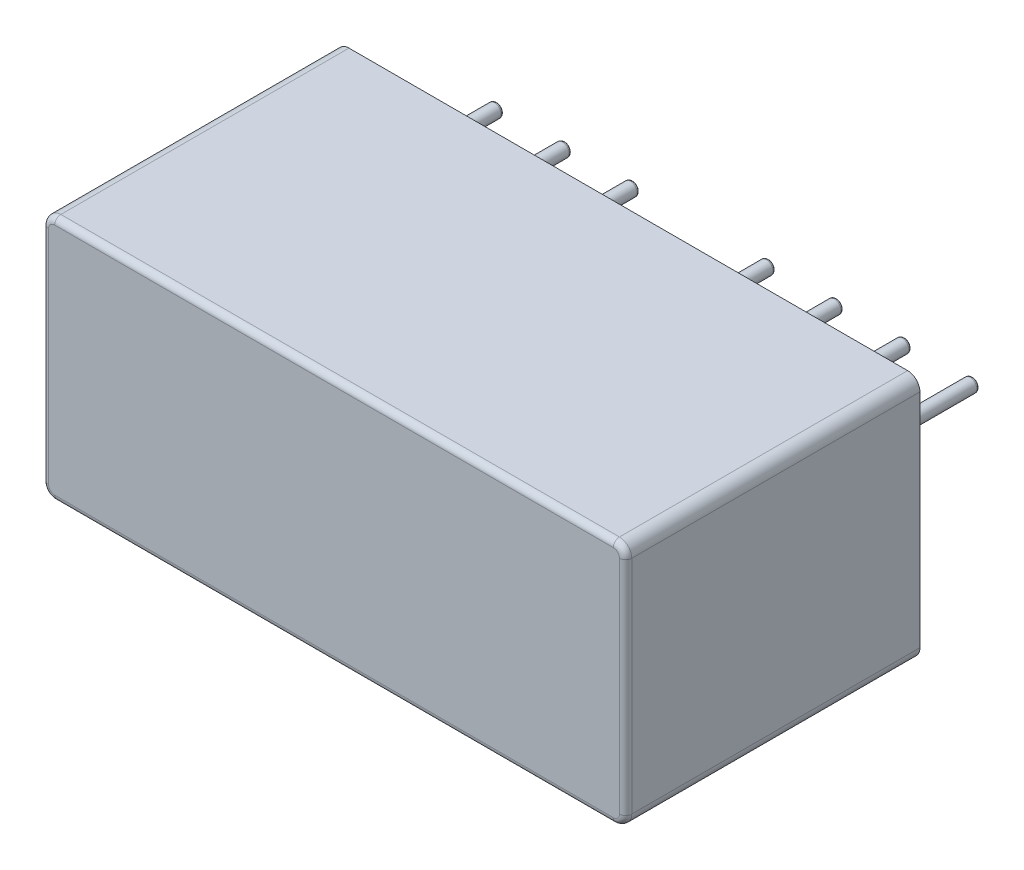
ISO-10303-21;
HEADER;
FILE_DESCRIPTION(('STEP AP214'),'2;1');
FILE_NAME('part.step','',(''),(''),'','','');
FILE_SCHEMA(('AUTOMOTIVE_DESIGN { 1 0 10303 214 1 1 1 1 }'));
ENDSEC;
DATA;
#1=APPLICATION_CONTEXT('core data for automotive mechanical design processes');
#2=APPLICATION_PROTOCOL_DEFINITION('international standard','automotive_design',2000,#1);
#3=PRODUCT_CONTEXT('',#1,'mechanical');
#4=PRODUCT('Part','Part','',(#3));
#5=PRODUCT_RELATED_PRODUCT_CATEGORY('part','',(#4));
#6=PRODUCT_DEFINITION_FORMATION('','',#4);
#7=PRODUCT_DEFINITION_CONTEXT('part definition',#1,'design');
#8=PRODUCT_DEFINITION('design','',#6,#7);
#9=PRODUCT_DEFINITION_SHAPE('','',#8);
#10=(LENGTH_UNIT() NAMED_UNIT(*) SI_UNIT(.MILLI.,.METRE.));
#11=(NAMED_UNIT(*) PLANE_ANGLE_UNIT() SI_UNIT($,.RADIAN.));
#12=(NAMED_UNIT(*) SI_UNIT($,.STERADIAN.) SOLID_ANGLE_UNIT());
#13=UNCERTAINTY_MEASURE_WITH_UNIT(LENGTH_MEASURE(1.E-05),#10,'distance_accuracy_value','');
#14=(GEOMETRIC_REPRESENTATION_CONTEXT(3) GLOBAL_UNCERTAINTY_ASSIGNED_CONTEXT((#13)) GLOBAL_UNIT_ASSIGNED_CONTEXT((#10,
#11,#12)) REPRESENTATION_CONTEXT('',''));
#15=CARTESIAN_POINT('',(0.,0.,0.));
#16=DIRECTION('',(0.,0.,1.));
#17=DIRECTION('',(1.,0.,0.));
#18=AXIS2_PLACEMENT_3D('',#15,#16,#17);
#19=CARTESIAN_POINT('',(0.,0.,-3.9));
#20=DIRECTION('',(0.,0.,1.));
#21=DIRECTION('',(1.,0.,0.));
#22=AXIS2_PLACEMENT_3D('',#19,#20,#21);
#23=PLANE('',#22);
#24=CARTESIAN_POINT('',(0.,0.,-3.9));
#25=DIRECTION('',(0.,0.,1.));
#26=DIRECTION('',(1.,0.,0.));
#27=AXIS2_PLACEMENT_3D('',#24,#25,#26);
#28=CIRCLE('',#27,0.15);
#29=CARTESIAN_POINT('',(0.15,0.,-3.9));
#30=VERTEX_POINT('',#29);
#31=EDGE_CURVE('E27',#30,#30,#28,.T.);
#32=ORIENTED_EDGE('',*,*,#31,.F.);
#33=EDGE_LOOP('',(#32));
#34=FACE_BOUND('',#33,.T.);
#35=ADVANCED_FACE('F17',(#34),#23,.F.);
#36=CARTESIAN_POINT('',(2.54,0.,-3.9));
#37=DIRECTION('',(0.,0.,1.));
#38=DIRECTION('',(1.,0.,0.));
#39=AXIS2_PLACEMENT_3D('',#36,#37,#38);
#40=PLANE('',#39);
#41=CARTESIAN_POINT('',(2.54,0.,-3.9));
#42=DIRECTION('',(0.,0.,1.));
#43=DIRECTION('',(1.,0.,0.));
#44=AXIS2_PLACEMENT_3D('',#41,#42,#43);
#45=CIRCLE('',#44,0.15);
#46=CARTESIAN_POINT('',(2.69,0.,-3.9));
#47=VERTEX_POINT('',#46);
#48=EDGE_CURVE('E398',#47,#47,#45,.T.);
#49=ORIENTED_EDGE('',*,*,#48,.F.);
#50=EDGE_LOOP('',(#49));
#51=FACE_BOUND('',#50,.T.);
#52=ADVANCED_FACE('F569',(#51),#40,.F.);
#53=CARTESIAN_POINT('',(10.16,0.,-3.9));
#54=DIRECTION('',(0.,0.,1.));
#55=DIRECTION('',(1.,0.,0.));
#56=AXIS2_PLACEMENT_3D('',#53,#54,#55);
#57=PLANE('',#56);
#58=CARTESIAN_POINT('',(10.16,0.,-3.9));
#59=DIRECTION('',(0.,0.,1.));
#60=DIRECTION('',(1.,0.,0.));
#61=AXIS2_PLACEMENT_3D('',#58,#59,#60);
#62=CIRCLE('',#61,0.15);
#63=CARTESIAN_POINT('',(10.31,0.,-3.9));
#64=VERTEX_POINT('',#63);
#65=EDGE_CURVE('E336',#64,#64,#62,.T.);
#66=ORIENTED_EDGE('',*,*,#65,.F.);
#67=EDGE_LOOP('',(#66));
#68=FACE_BOUND('',#67,.T.);
#69=ADVANCED_FACE('F576',(#68),#57,.F.);
#70=CARTESIAN_POINT('',(5.08,0.,-3.9));
#71=DIRECTION('',(0.,0.,1.));
#72=DIRECTION('',(1.,0.,0.));
#73=AXIS2_PLACEMENT_3D('',#70,#71,#72);
#74=PLANE('',#73);
#75=CARTESIAN_POINT('',(5.08,0.,-3.9));
#76=DIRECTION('',(0.,0.,1.));
#77=DIRECTION('',(1.,0.,0.));
#78=AXIS2_PLACEMENT_3D('',#75,#76,#77);
#79=CIRCLE('',#78,0.15);
#80=CARTESIAN_POINT('',(5.23,0.,-3.9));
#81=VERTEX_POINT('',#80);
#82=EDGE_CURVE('E334',#81,#81,#79,.T.);
#83=ORIENTED_EDGE('',*,*,#82,.F.);
#84=EDGE_LOOP('',(#83));
#85=FACE_BOUND('',#84,.T.);
#86=ADVANCED_FACE('F628',(#85),#74,.F.);
#87=CARTESIAN_POINT('',(12.7,0.,-3.9));
#88=DIRECTION('',(0.,0.,1.));
#89=DIRECTION('',(1.,0.,0.));
#90=AXIS2_PLACEMENT_3D('',#87,#88,#89);
#91=PLANE('',#90);
#92=CARTESIAN_POINT('',(12.7,0.,-3.9));
#93=DIRECTION('',(0.,0.,1.));
#94=DIRECTION('',(1.,0.,0.));
#95=AXIS2_PLACEMENT_3D('',#92,#93,#94);
#96=CIRCLE('',#95,0.15);
#97=CARTESIAN_POINT('',(12.85,0.,-3.9));
#98=VERTEX_POINT('',#97);
#99=EDGE_CURVE('E335',#98,#98,#96,.T.);
#100=ORIENTED_EDGE('',*,*,#99,.F.);
#101=EDGE_LOOP('',(#100));
#102=FACE_BOUND('',#101,.T.);
#103=ADVANCED_FACE('F625',(#102),#91,.F.);
#104=CARTESIAN_POINT('',(15.24,0.,-3.9));
#105=DIRECTION('',(0.,0.,1.));
#106=DIRECTION('',(1.,0.,0.));
#107=AXIS2_PLACEMENT_3D('',#104,#105,#106);
#108=PLANE('',#107);
#109=CARTESIAN_POINT('',(15.24,0.,-3.9));
#110=DIRECTION('',(0.,0.,1.));
#111=DIRECTION('',(1.,0.,0.));
#112=AXIS2_PLACEMENT_3D('',#109,#110,#111);
#113=CIRCLE('',#112,0.15);
#114=CARTESIAN_POINT('',(15.39,0.,-3.9));
#115=VERTEX_POINT('',#114);
#116=EDGE_CURVE('E306',#115,#115,#113,.T.);
#117=ORIENTED_EDGE('',*,*,#116,.F.);
#118=EDGE_LOOP('',(#117));
#119=FACE_BOUND('',#118,.T.);
#120=ADVANCED_FACE('F627',(#119),#108,.F.);
#121=CARTESIAN_POINT('',(8.9,-1.4,11.1));
#122=DIRECTION('',(0.,0.,-1.));
#123=DIRECTION('',(0.,-1.,0.));
#124=AXIS2_PLACEMENT_3D('',#121,#122,#123);
#125=PLANE('',#124);
#126=CARTESIAN_POINT('',(-1.54,2.74,11.1));
#127=DIRECTION('',(0.,0.,-1.));
#128=DIRECTION('',(-1.,0.,0.));
#129=AXIS2_PLACEMENT_3D('',#126,#127,#128);
#130=CIRCLE('',#129,0.23);
#131=CARTESIAN_POINT('',(-1.77,2.74,11.1));
#132=VERTEX_POINT('',#131);
#133=CARTESIAN_POINT('',(-1.54,2.97,11.1));
#134=VERTEX_POINT('',#133);
#135=EDGE_CURVE('E442',#132,#134,#130,.T.);
#136=ORIENTED_EDGE('',*,*,#135,.F.);
#137=DIRECTION('',(0.,1.,0.));
#138=VECTOR('',#137,1.);
#139=CARTESIAN_POINT('',(-1.77,-5.54,11.1));
#140=LINE('',#139,#138);
#141=CARTESIAN_POINT('',(-1.77,-5.54,11.1));
#142=VERTEX_POINT('',#141);
#143=EDGE_CURVE('E310',#142,#132,#140,.T.);
#144=ORIENTED_EDGE('',*,*,#143,.F.);
#145=CARTESIAN_POINT('',(-1.54,-5.54,11.1));
#146=DIRECTION('',(0.,0.,-1.));
#147=DIRECTION('',(0.,-1.,0.));
#148=AXIS2_PLACEMENT_3D('',#145,#146,#147);
#149=CIRCLE('',#148,0.23);
#150=CARTESIAN_POINT('',(-1.54,-5.77,11.1));
#151=VERTEX_POINT('',#150);
#152=EDGE_CURVE('E352',#151,#142,#149,.T.);
#153=ORIENTED_EDGE('',*,*,#152,.F.);
#154=DIRECTION('',(-1.,0.,0.));
#155=VECTOR('',#154,1.);
#156=CARTESIAN_POINT('',(19.34,-5.77,11.1));
#157=LINE('',#156,#155);
#158=CARTESIAN_POINT('',(19.34,-5.77,11.1));
#159=VERTEX_POINT('',#158);
#160=EDGE_CURVE('E365',#159,#151,#157,.T.);
#161=ORIENTED_EDGE('',*,*,#160,.F.);
#162=CARTESIAN_POINT('',(19.34,-5.54,11.1));
#163=DIRECTION('',(0.,0.,-1.));
#164=DIRECTION('',(1.,0.,0.));
#165=AXIS2_PLACEMENT_3D('',#162,#163,#164);
#166=CIRCLE('',#165,0.23);
#167=CARTESIAN_POINT('',(19.57,-5.54,11.1));
#168=VERTEX_POINT('',#167);
#169=EDGE_CURVE('E271',#168,#159,#166,.T.);
#170=ORIENTED_EDGE('',*,*,#169,.F.);
#171=DIRECTION('',(0.,-1.,0.));
#172=VECTOR('',#171,1.);
#173=CARTESIAN_POINT('',(19.57,2.74,11.1));
#174=LINE('',#173,#172);
#175=CARTESIAN_POINT('',(19.57,2.74,11.1));
#176=VERTEX_POINT('',#175);
#177=EDGE_CURVE('E304',#176,#168,#174,.T.);
#178=ORIENTED_EDGE('',*,*,#177,.F.);
#179=CARTESIAN_POINT('',(19.34,2.74,11.1));
#180=DIRECTION('',(0.,0.,-1.));
#181=DIRECTION('',(0.,1.,0.));
#182=AXIS2_PLACEMENT_3D('',#179,#180,#181);
#183=CIRCLE('',#182,0.23);
#184=CARTESIAN_POINT('',(19.34,2.97,11.1));
#185=VERTEX_POINT('',#184);
#186=EDGE_CURVE('E330',#185,#176,#183,.T.);
#187=ORIENTED_EDGE('',*,*,#186,.F.);
#188=DIRECTION('',(1.,0.,0.));
#189=VECTOR('',#188,1.);
#190=CARTESIAN_POINT('',(-1.54,2.97,11.1));
#191=LINE('',#190,#189);
#192=EDGE_CURVE('E228',#134,#185,#191,.T.);
#193=ORIENTED_EDGE('',*,*,#192,.F.);
#194=EDGE_LOOP('',(#136,#144,#153,#161,#170,#178,#187,#193));
#195=FACE_BOUND('',#194,.T.);
#196=ADVANCED_FACE('F503',(#195),#125,.F.);
#197=CARTESIAN_POINT('',(0.,0.,-3.8));
#198=DIRECTION('',(0.,0.,-1.));
#199=DIRECTION('',(1.,0.,0.));
#200=AXIS2_PLACEMENT_3D('',#197,#198,#199);
#201=TOROIDAL_SURFACE('',#200,0.15,0.1);
#202=ORIENTED_EDGE('',*,*,#31,.T.);
#203=CARTESIAN_POINT('',(0.15,0.,-3.8));
#204=DIRECTION('',(0.,1.,0.));
#205=DIRECTION('',(1.,0.,0.));
#206=AXIS2_PLACEMENT_3D('',#203,#204,#205);
#207=CIRCLE('',#206,0.1);
#208=CARTESIAN_POINT('',(0.25,0.,-3.8));
#209=VERTEX_POINT('',#208);
#210=EDGE_CURVE('E11',#209,#30,#207,.T.);
#211=ORIENTED_EDGE('',*,*,#210,.F.);
#212=CARTESIAN_POINT('',(0.,0.,-3.8));
#213=DIRECTION('',(0.,0.,1.));
#214=DIRECTION('',(1.,0.,0.));
#215=AXIS2_PLACEMENT_3D('',#212,#213,#214);
#216=CIRCLE('',#215,0.25);
#217=EDGE_CURVE('E305',#209,#209,#216,.T.);
#218=ORIENTED_EDGE('',*,*,#217,.F.);
#219=ORIENTED_EDGE('',*,*,#210,.T.);
#220=EDGE_LOOP('',(#202,#211,#218,#219));
#221=FACE_BOUND('',#220,.T.);
#222=ADVANCED_FACE('F612',(#221),#201,.T.);
#223=CARTESIAN_POINT('',(2.54,0.,-3.8));
#224=DIRECTION('',(0.,0.,-1.));
#225=DIRECTION('',(1.,0.,0.));
#226=AXIS2_PLACEMENT_3D('',#223,#224,#225);
#227=TOROIDAL_SURFACE('',#226,0.15,0.1);
#228=ORIENTED_EDGE('',*,*,#48,.T.);
#229=CARTESIAN_POINT('',(2.69,0.,-3.8));
#230=DIRECTION('',(0.,1.,0.));
#231=DIRECTION('',(1.,0.,0.));
#232=AXIS2_PLACEMENT_3D('',#229,#230,#231);
#233=CIRCLE('',#232,0.1);
#234=CARTESIAN_POINT('',(2.79,0.,-3.8));
#235=VERTEX_POINT('',#234);
#236=EDGE_CURVE('E50',#235,#47,#233,.T.);
#237=ORIENTED_EDGE('',*,*,#236,.F.);
#238=CARTESIAN_POINT('',(2.54,0.,-3.8));
#239=DIRECTION('',(0.,0.,1.));
#240=DIRECTION('',(1.,0.,0.));
#241=AXIS2_PLACEMENT_3D('',#238,#239,#240);
#242=CIRCLE('',#241,0.25);
#243=EDGE_CURVE('E284',#235,#235,#242,.T.);
#244=ORIENTED_EDGE('',*,*,#243,.F.);
#245=ORIENTED_EDGE('',*,*,#236,.T.);
#246=EDGE_LOOP('',(#228,#237,#244,#245));
#247=FACE_BOUND('',#246,.T.);
#248=ADVANCED_FACE('F608',(#247),#227,.T.);
#249=CARTESIAN_POINT('',(10.16,0.,-3.8));
#250=DIRECTION('',(0.,0.,-1.));
#251=DIRECTION('',(1.,0.,0.));
#252=AXIS2_PLACEMENT_3D('',#249,#250,#251);
#253=TOROIDAL_SURFACE('',#252,0.15,0.1);
#254=ORIENTED_EDGE('',*,*,#65,.T.);
#255=CARTESIAN_POINT('',(10.31,0.,-3.8));
#256=DIRECTION('',(0.,1.,0.));
#257=DIRECTION('',(1.,0.,0.));
#258=AXIS2_PLACEMENT_3D('',#255,#256,#257);
#259=CIRCLE('',#258,0.1);
#260=CARTESIAN_POINT('',(10.41,0.,-3.8));
#261=VERTEX_POINT('',#260);
#262=EDGE_CURVE('E340',#261,#64,#259,.T.);
#263=ORIENTED_EDGE('',*,*,#262,.F.);
#264=CARTESIAN_POINT('',(10.16,0.,-3.8));
#265=DIRECTION('',(0.,0.,1.));
#266=DIRECTION('',(1.,0.,0.));
#267=AXIS2_PLACEMENT_3D('',#264,#265,#266);
#268=CIRCLE('',#267,0.25);
#269=EDGE_CURVE('E321',#261,#261,#268,.T.);
#270=ORIENTED_EDGE('',*,*,#269,.F.);
#271=ORIENTED_EDGE('',*,*,#262,.T.);
#272=EDGE_LOOP('',(#254,#263,#270,#271));
#273=FACE_BOUND('',#272,.T.);
#274=ADVANCED_FACE('F604',(#273),#253,.T.);
#275=CARTESIAN_POINT('',(5.08,0.,-3.8));
#276=DIRECTION('',(0.,0.,-1.));
#277=DIRECTION('',(1.,0.,0.));
#278=AXIS2_PLACEMENT_3D('',#275,#276,#277);
#279=TOROIDAL_SURFACE('',#278,0.15,0.1);
#280=ORIENTED_EDGE('',*,*,#82,.T.);
#281=CARTESIAN_POINT('',(5.23,0.,-3.8));
#282=DIRECTION('',(0.,1.,0.));
#283=DIRECTION('',(1.,0.,0.));
#284=AXIS2_PLACEMENT_3D('',#281,#282,#283);
#285=CIRCLE('',#284,0.1);
#286=CARTESIAN_POINT('',(5.33,0.,-3.8));
#287=VERTEX_POINT('',#286);
#288=EDGE_CURVE('E341',#287,#81,#285,.T.);
#289=ORIENTED_EDGE('',*,*,#288,.F.);
#290=CARTESIAN_POINT('',(5.08,0.,-3.8));
#291=DIRECTION('',(0.,0.,1.));
#292=DIRECTION('',(1.,0.,0.));
#293=AXIS2_PLACEMENT_3D('',#290,#291,#292);
#294=CIRCLE('',#293,0.25);
#295=EDGE_CURVE('E234',#287,#287,#294,.T.);
#296=ORIENTED_EDGE('',*,*,#295,.F.);
#297=ORIENTED_EDGE('',*,*,#288,.T.);
#298=EDGE_LOOP('',(#280,#289,#296,#297));
#299=FACE_BOUND('',#298,.T.);
#300=ADVANCED_FACE('F607',(#299),#279,.T.);
#301=CARTESIAN_POINT('',(12.7,0.,-3.8));
#302=DIRECTION('',(0.,0.,-1.));
#303=DIRECTION('',(1.,0.,0.));
#304=AXIS2_PLACEMENT_3D('',#301,#302,#303);
#305=TOROIDAL_SURFACE('',#304,0.15,0.1);
#306=ORIENTED_EDGE('',*,*,#99,.T.);
#307=CARTESIAN_POINT('',(12.85,0.,-3.8));
#308=DIRECTION('',(0.,1.,0.));
#309=DIRECTION('',(1.,0.,0.));
#310=AXIS2_PLACEMENT_3D('',#307,#308,#309);
#311=CIRCLE('',#310,0.1);
#312=CARTESIAN_POINT('',(12.95,0.,-3.8));
#313=VERTEX_POINT('',#312);
#314=EDGE_CURVE('E331',#313,#98,#311,.T.);
#315=ORIENTED_EDGE('',*,*,#314,.F.);
#316=CARTESIAN_POINT('',(12.7,0.,-3.8));
#317=DIRECTION('',(0.,0.,1.));
#318=DIRECTION('',(1.,0.,0.));
#319=AXIS2_PLACEMENT_3D('',#316,#317,#318);
#320=CIRCLE('',#319,0.25);
#321=EDGE_CURVE('E235',#313,#313,#320,.T.);
#322=ORIENTED_EDGE('',*,*,#321,.F.);
#323=ORIENTED_EDGE('',*,*,#314,.T.);
#324=EDGE_LOOP('',(#306,#315,#322,#323));
#325=FACE_BOUND('',#324,.T.);
#326=ADVANCED_FACE('F19',(#325),#305,.T.);
#327=CARTESIAN_POINT('',(15.24,0.,-3.8));
#328=DIRECTION('',(0.,0.,-1.));
#329=DIRECTION('',(1.,0.,0.));
#330=AXIS2_PLACEMENT_3D('',#327,#328,#329);
#331=TOROIDAL_SURFACE('',#330,0.15,0.1);
#332=ORIENTED_EDGE('',*,*,#116,.T.);
#333=CARTESIAN_POINT('',(15.39,0.,-3.8));
#334=DIRECTION('',(0.,1.,0.));
#335=DIRECTION('',(1.,0.,0.));
#336=AXIS2_PLACEMENT_3D('',#333,#334,#335);
#337=CIRCLE('',#336,0.1);
#338=CARTESIAN_POINT('',(15.49,0.,-3.8));
#339=VERTEX_POINT('',#338);
#340=EDGE_CURVE('E309',#339,#115,#337,.T.);
#341=ORIENTED_EDGE('',*,*,#340,.F.);
#342=CARTESIAN_POINT('',(15.24,0.,-3.8));
#343=DIRECTION('',(0.,0.,1.));
#344=DIRECTION('',(1.,0.,0.));
#345=AXIS2_PLACEMENT_3D('',#342,#343,#344);
#346=CIRCLE('',#345,0.25);
#347=EDGE_CURVE('E312',#339,#339,#346,.T.);
#348=ORIENTED_EDGE('',*,*,#347,.F.);
#349=ORIENTED_EDGE('',*,*,#340,.T.);
#350=EDGE_LOOP('',(#332,#341,#348,#349));
#351=FACE_BOUND('',#350,.T.);
#352=ADVANCED_FACE('F589',(#351),#331,.T.);
#353=CARTESIAN_POINT('',(-1.77,-5.54,10.87));
#354=DIRECTION('',(0.,1.,0.));
#355=DIRECTION('',(-1.,0.,0.));
#356=AXIS2_PLACEMENT_3D('',#353,#354,#355);
#357=CYLINDRICAL_SURFACE('',#356,0.23);
#358=CARTESIAN_POINT('',(-1.77,-5.54,10.87));
#359=DIRECTION('',(0.,1.,0.));
#360=DIRECTION('',(-1.,0.,0.));
#361=AXIS2_PLACEMENT_3D('',#358,#359,#360);
#362=CIRCLE('',#361,0.23);
#363=CARTESIAN_POINT('',(-2.,-5.54,10.87));
#364=VERTEX_POINT('',#363);
#365=EDGE_CURVE('E356',#364,#142,#362,.T.);
#366=ORIENTED_EDGE('',*,*,#365,.T.);
#367=ORIENTED_EDGE('',*,*,#143,.T.);
#368=CARTESIAN_POINT('',(-1.77,2.74,10.87));
#369=DIRECTION('',(0.,1.,0.));
#370=DIRECTION('',(-1.,0.,0.));
#371=AXIS2_PLACEMENT_3D('',#368,#369,#370);
#372=CIRCLE('',#371,0.23);
#373=CARTESIAN_POINT('',(-2.,2.74,10.87));
#374=VERTEX_POINT('',#373);
#375=EDGE_CURVE('E357',#374,#132,#372,.T.);
#376=ORIENTED_EDGE('',*,*,#375,.F.);
#377=DIRECTION('',(0.,1.,0.));
#378=VECTOR('',#377,1.);
#379=CARTESIAN_POINT('',(-2.,-5.54,10.87));
#380=LINE('',#379,#378);
#381=EDGE_CURVE('E298',#364,#374,#380,.T.);
#382=ORIENTED_EDGE('',*,*,#381,.F.);
#383=EDGE_LOOP('',(#366,#367,#376,#382));
#384=FACE_BOUND('',#383,.T.);
#385=ADVANCED_FACE('F586',(#384),#357,.T.);
#386=CARTESIAN_POINT('',(-1.54,-5.54,10.87));
#387=DIRECTION('',(0.,0.,1.));
#388=DIRECTION('',(0.,-1.,0.));
#389=AXIS2_PLACEMENT_3D('',#386,#387,#388);
#390=DEGENERATE_TOROIDAL_SURFACE('',#389,0.23,0.23,.T.);
#391=ORIENTED_EDGE('',*,*,#152,.T.);
#392=ORIENTED_EDGE('',*,*,#365,.F.);
#393=CARTESIAN_POINT('',(-1.54,-5.54,10.87));
#394=DIRECTION('',(0.,0.,-1.));
#395=DIRECTION('',(0.,-1.,0.));
#396=AXIS2_PLACEMENT_3D('',#393,#394,#395);
#397=CIRCLE('',#396,0.46);
#398=CARTESIAN_POINT('',(-1.54,-6.,10.87));
#399=VERTEX_POINT('',#398);
#400=EDGE_CURVE('E299',#399,#364,#397,.T.);
#401=ORIENTED_EDGE('',*,*,#400,.F.);
#402=CARTESIAN_POINT('',(-1.54,-5.77,10.87));
#403=DIRECTION('',(-1.,0.,0.));
#404=DIRECTION('',(0.,-1.,0.));
#405=AXIS2_PLACEMENT_3D('',#402,#403,#404);
#406=CIRCLE('',#405,0.23);
#407=EDGE_CURVE('E369',#399,#151,#406,.T.);
#408=ORIENTED_EDGE('',*,*,#407,.T.);
#409=EDGE_LOOP('',(#391,#392,#401,#408));
#410=FACE_BOUND('',#409,.T.);
#411=ADVANCED_FACE('F585',(#410),#390,.T.);
#412=CARTESIAN_POINT('',(-1.54,2.74,10.87));
#413=DIRECTION('',(0.,0.,1.));
#414=DIRECTION('',(-1.,0.,0.));
#415=AXIS2_PLACEMENT_3D('',#412,#413,#414);
#416=DEGENERATE_TOROIDAL_SURFACE('',#415,0.23,0.23,.T.);
#417=ORIENTED_EDGE('',*,*,#135,.T.);
#418=CARTESIAN_POINT('',(-1.54,2.97,10.87));
#419=DIRECTION('',(1.,0.,0.));
#420=DIRECTION('',(0.,1.,0.));
#421=AXIS2_PLACEMENT_3D('',#418,#419,#420);
#422=CIRCLE('',#421,0.23);
#423=CARTESIAN_POINT('',(-1.54,3.2,10.87));
#424=VERTEX_POINT('',#423);
#425=EDGE_CURVE('E225',#424,#134,#422,.T.);
#426=ORIENTED_EDGE('',*,*,#425,.F.);
#427=CARTESIAN_POINT('',(-1.54,2.74,10.87));
#428=DIRECTION('',(0.,0.,-1.));
#429=DIRECTION('',(-1.,0.,0.));
#430=AXIS2_PLACEMENT_3D('',#427,#428,#429);
#431=CIRCLE('',#430,0.46);
#432=EDGE_CURVE('E386',#374,#424,#431,.T.);
#433=ORIENTED_EDGE('',*,*,#432,.F.);
#434=ORIENTED_EDGE('',*,*,#375,.T.);
#435=EDGE_LOOP('',(#417,#426,#433,#434));
#436=FACE_BOUND('',#435,.T.);
#437=ADVANCED_FACE('F440',(#436),#416,.T.);
#438=CARTESIAN_POINT('',(19.34,-5.77,10.87));
#439=DIRECTION('',(-1.,0.,0.));
#440=DIRECTION('',(0.,-1.,0.));
#441=AXIS2_PLACEMENT_3D('',#438,#439,#440);
#442=CYLINDRICAL_SURFACE('',#441,0.23);
#443=CARTESIAN_POINT('',(19.34,-5.77,10.87));
#444=DIRECTION('',(-1.,0.,0.));
#445=DIRECTION('',(0.,-1.,0.));
#446=AXIS2_PLACEMENT_3D('',#443,#444,#445);
#447=CIRCLE('',#446,0.23);
#448=CARTESIAN_POINT('',(19.34,-6.,10.87));
#449=VERTEX_POINT('',#448);
#450=EDGE_CURVE('E229',#449,#159,#447,.T.);
#451=ORIENTED_EDGE('',*,*,#450,.T.);
#452=ORIENTED_EDGE('',*,*,#160,.T.);
#453=ORIENTED_EDGE('',*,*,#407,.F.);
#454=DIRECTION('',(-1.,0.,0.));
#455=VECTOR('',#454,1.);
#456=CARTESIAN_POINT('',(19.34,-6.,10.87));
#457=LINE('',#456,#455);
#458=EDGE_CURVE('E290',#449,#399,#457,.T.);
#459=ORIENTED_EDGE('',*,*,#458,.F.);
#460=EDGE_LOOP('',(#451,#452,#453,#459));
#461=FACE_BOUND('',#460,.T.);
#462=ADVANCED_FACE('F506',(#461),#442,.T.);
#463=CARTESIAN_POINT('',(-1.54,2.97,10.87));
#464=DIRECTION('',(1.,0.,0.));
#465=DIRECTION('',(0.,1.,0.));
#466=AXIS2_PLACEMENT_3D('',#463,#464,#465);
#467=CYLINDRICAL_SURFACE('',#466,0.23);
#468=ORIENTED_EDGE('',*,*,#425,.T.);
#469=ORIENTED_EDGE('',*,*,#192,.T.);
#470=CARTESIAN_POINT('',(19.34,2.97,10.87));
#471=DIRECTION('',(1.,0.,0.));
#472=DIRECTION('',(0.,1.,0.));
#473=AXIS2_PLACEMENT_3D('',#470,#471,#472);
#474=CIRCLE('',#473,0.23);
#475=CARTESIAN_POINT('',(19.34,3.2,10.87));
#476=VERTEX_POINT('',#475);
#477=EDGE_CURVE('E385',#476,#185,#474,.T.);
#478=ORIENTED_EDGE('',*,*,#477,.F.);
#479=DIRECTION('',(1.,0.,0.));
#480=VECTOR('',#479,1.);
#481=CARTESIAN_POINT('',(-1.54,3.2,10.87));
#482=LINE('',#481,#480);
#483=EDGE_CURVE('E254',#424,#476,#482,.T.);
#484=ORIENTED_EDGE('',*,*,#483,.F.);
#485=EDGE_LOOP('',(#468,#469,#478,#484));
#486=FACE_BOUND('',#485,.T.);
#487=ADVANCED_FACE('F445',(#486),#467,.T.);
#488=CARTESIAN_POINT('',(19.34,-5.54,10.87));
#489=DIRECTION('',(0.,0.,1.));
#490=DIRECTION('',(1.,0.,0.));
#491=AXIS2_PLACEMENT_3D('',#488,#489,#490);
#492=DEGENERATE_TOROIDAL_SURFACE('',#491,0.23,0.23,.T.);
#493=ORIENTED_EDGE('',*,*,#169,.T.);
#494=ORIENTED_EDGE('',*,*,#450,.F.);
#495=CARTESIAN_POINT('',(19.34,-5.54,10.87));
#496=DIRECTION('',(0.,0.,-1.));
#497=DIRECTION('',(1.,0.,0.));
#498=AXIS2_PLACEMENT_3D('',#495,#496,#497);
#499=CIRCLE('',#498,0.46);
#500=CARTESIAN_POINT('',(19.8,-5.54,10.87));
#501=VERTEX_POINT('',#500);
#502=EDGE_CURVE('E241',#501,#449,#499,.T.);
#503=ORIENTED_EDGE('',*,*,#502,.F.);
#504=CARTESIAN_POINT('',(19.57,-5.54,10.87));
#505=DIRECTION('',(0.,-1.,0.));
#506=DIRECTION('',(1.,0.,0.));
#507=AXIS2_PLACEMENT_3D('',#504,#505,#506);
#508=CIRCLE('',#507,0.23);
#509=EDGE_CURVE('E326',#501,#168,#508,.T.);
#510=ORIENTED_EDGE('',*,*,#509,.T.);
#511=EDGE_LOOP('',(#493,#494,#503,#510));
#512=FACE_BOUND('',#511,.T.);
#513=ADVANCED_FACE('F498',(#512),#492,.T.);
#514=CARTESIAN_POINT('',(19.34,2.74,10.87));
#515=DIRECTION('',(0.,0.,1.));
#516=DIRECTION('',(0.,1.,0.));
#517=AXIS2_PLACEMENT_3D('',#514,#515,#516);
#518=DEGENERATE_TOROIDAL_SURFACE('',#517,0.23,0.23,.T.);
#519=ORIENTED_EDGE('',*,*,#186,.T.);
#520=CARTESIAN_POINT('',(19.57,2.74,10.87));
#521=DIRECTION('',(0.,-1.,0.));
#522=DIRECTION('',(1.,0.,0.));
#523=AXIS2_PLACEMENT_3D('',#520,#521,#522);
#524=CIRCLE('',#523,0.23);
#525=CARTESIAN_POINT('',(19.8,2.74,10.87));
#526=VERTEX_POINT('',#525);
#527=EDGE_CURVE('E300',#526,#176,#524,.T.);
#528=ORIENTED_EDGE('',*,*,#527,.F.);
#529=CARTESIAN_POINT('',(19.34,2.74,10.87));
#530=DIRECTION('',(0.,0.,-1.));
#531=DIRECTION('',(0.,1.,0.));
#532=AXIS2_PLACEMENT_3D('',#529,#530,#531);
#533=CIRCLE('',#532,0.46);
#534=EDGE_CURVE('E257',#476,#526,#533,.T.);
#535=ORIENTED_EDGE('',*,*,#534,.F.);
#536=ORIENTED_EDGE('',*,*,#477,.T.);
#537=EDGE_LOOP('',(#519,#528,#535,#536));
#538=FACE_BOUND('',#537,.T.);
#539=ADVANCED_FACE('F591',(#538),#518,.T.);
#540=CARTESIAN_POINT('',(19.57,2.74,10.87));
#541=DIRECTION('',(0.,-1.,0.));
#542=DIRECTION('',(1.,0.,0.));
#543=AXIS2_PLACEMENT_3D('',#540,#541,#542);
#544=CYLINDRICAL_SURFACE('',#543,0.23);
#545=ORIENTED_EDGE('',*,*,#527,.T.);
#546=ORIENTED_EDGE('',*,*,#177,.T.);
#547=ORIENTED_EDGE('',*,*,#509,.F.);
#548=DIRECTION('',(0.,-1.,0.));
#549=VECTOR('',#548,1.);
#550=CARTESIAN_POINT('',(19.8,2.74,10.87));
#551=LINE('',#550,#549);
#552=EDGE_CURVE('E370',#526,#501,#551,.T.);
#553=ORIENTED_EDGE('',*,*,#552,.F.);
#554=EDGE_LOOP('',(#545,#546,#547,#553));
#555=FACE_BOUND('',#554,.T.);
#556=ADVANCED_FACE('F522',(#555),#544,.T.);
#557=CARTESIAN_POINT('',(0.,0.,0.2));
#558=DIRECTION('',(0.,0.,1.));
#559=DIRECTION('',(1.,0.,0.));
#560=AXIS2_PLACEMENT_3D('',#557,#558,#559);
#561=CYLINDRICAL_SURFACE('',#560,0.25);
#562=CARTESIAN_POINT('',(0.,0.,0.1));
#563=DIRECTION('',(0.,0.,1.));
#564=DIRECTION('',(1.,0.,0.));
#565=AXIS2_PLACEMENT_3D('',#562,#563,#564);
#566=CIRCLE('',#565,0.25);
#567=CARTESIAN_POINT('',(0.25,0.,0.1));
#568=VERTEX_POINT('',#567);
#569=EDGE_CURVE('E416',#568,#568,#566,.T.);
#570=ORIENTED_EDGE('',*,*,#569,.F.);
#571=DIRECTION('',(0.,0.,-1.));
#572=VECTOR('',#571,1.);
#573=CARTESIAN_POINT('',(0.25,0.,0.2));
#574=LINE('',#573,#572);
#575=EDGE_CURVE('E288',#568,#209,#574,.T.);
#576=ORIENTED_EDGE('',*,*,#575,.T.);
#577=ORIENTED_EDGE('',*,*,#217,.T.);
#578=ORIENTED_EDGE('',*,*,#575,.F.);
#579=EDGE_LOOP('',(#570,#576,#577,#578));
#580=FACE_BOUND('',#579,.T.);
#581=ADVANCED_FACE('F603',(#580),#561,.T.);
#582=CARTESIAN_POINT('',(2.54,0.,0.2));
#583=DIRECTION('',(0.,0.,1.));
#584=DIRECTION('',(1.,0.,0.));
#585=AXIS2_PLACEMENT_3D('',#582,#583,#584);
#586=CYLINDRICAL_SURFACE('',#585,0.25);
#587=CARTESIAN_POINT('',(2.54,0.,0.1));
#588=DIRECTION('',(0.,0.,1.));
#589=DIRECTION('',(1.,0.,0.));
#590=AXIS2_PLACEMENT_3D('',#587,#588,#589);
#591=CIRCLE('',#590,0.25);
#592=CARTESIAN_POINT('',(2.79,0.,0.1));
#593=VERTEX_POINT('',#592);
#594=EDGE_CURVE('E382',#593,#593,#591,.T.);
#595=ORIENTED_EDGE('',*,*,#594,.F.);
#596=DIRECTION('',(0.,0.,-1.));
#597=VECTOR('',#596,1.);
#598=CARTESIAN_POINT('',(2.79,0.,0.2));
#599=LINE('',#598,#597);
#600=EDGE_CURVE('E289',#593,#235,#599,.T.);
#601=ORIENTED_EDGE('',*,*,#600,.T.);
#602=ORIENTED_EDGE('',*,*,#243,.T.);
#603=ORIENTED_EDGE('',*,*,#600,.F.);
#604=EDGE_LOOP('',(#595,#601,#602,#603));
#605=FACE_BOUND('',#604,.T.);
#606=ADVANCED_FACE('F461',(#605),#586,.T.);
#607=CARTESIAN_POINT('',(10.16,0.,0.2));
#608=DIRECTION('',(0.,0.,1.));
#609=DIRECTION('',(1.,0.,0.));
#610=AXIS2_PLACEMENT_3D('',#607,#608,#609);
#611=CYLINDRICAL_SURFACE('',#610,0.25);
#612=CARTESIAN_POINT('',(10.16,0.,0.1));
#613=DIRECTION('',(0.,0.,1.));
#614=DIRECTION('',(1.,0.,0.));
#615=AXIS2_PLACEMENT_3D('',#612,#613,#614);
#616=CIRCLE('',#615,0.25);
#617=CARTESIAN_POINT('',(10.41,0.,0.1));
#618=VERTEX_POINT('',#617);
#619=EDGE_CURVE('E348',#618,#618,#616,.T.);
#620=ORIENTED_EDGE('',*,*,#619,.F.);
#621=DIRECTION('',(0.,0.,-1.));
#622=VECTOR('',#621,1.);
#623=CARTESIAN_POINT('',(10.41,0.,0.2));
#624=LINE('',#623,#622);
#625=EDGE_CURVE('E317',#618,#261,#624,.T.);
#626=ORIENTED_EDGE('',*,*,#625,.T.);
#627=ORIENTED_EDGE('',*,*,#269,.T.);
#628=ORIENTED_EDGE('',*,*,#625,.F.);
#629=EDGE_LOOP('',(#620,#626,#627,#628));
#630=FACE_BOUND('',#629,.T.);
#631=ADVANCED_FACE('F602',(#630),#611,.T.);
#632=CARTESIAN_POINT('',(5.08,0.,0.2));
#633=DIRECTION('',(0.,0.,1.));
#634=DIRECTION('',(1.,0.,0.));
#635=AXIS2_PLACEMENT_3D('',#632,#633,#634);
#636=CYLINDRICAL_SURFACE('',#635,0.25);
#637=CARTESIAN_POINT('',(5.08,0.,0.1));
#638=DIRECTION('',(0.,0.,1.));
#639=DIRECTION('',(1.,0.,0.));
#640=AXIS2_PLACEMENT_3D('',#637,#638,#639);
#641=CIRCLE('',#640,0.25);
#642=CARTESIAN_POINT('',(5.33,0.,0.1));
#643=VERTEX_POINT('',#642);
#644=EDGE_CURVE('E279',#643,#643,#641,.T.);
#645=ORIENTED_EDGE('',*,*,#644,.F.);
#646=DIRECTION('',(0.,0.,-1.));
#647=VECTOR('',#646,1.);
#648=CARTESIAN_POINT('',(5.33,0.,0.2));
#649=LINE('',#648,#647);
#650=EDGE_CURVE('E230',#643,#287,#649,.T.);
#651=ORIENTED_EDGE('',*,*,#650,.T.);
#652=ORIENTED_EDGE('',*,*,#295,.T.);
#653=ORIENTED_EDGE('',*,*,#650,.F.);
#654=EDGE_LOOP('',(#645,#651,#652,#653));
#655=FACE_BOUND('',#654,.T.);
#656=ADVANCED_FACE('F598',(#655),#636,.T.);
#657=CARTESIAN_POINT('',(12.7,0.,0.2));
#658=DIRECTION('',(0.,0.,1.));
#659=DIRECTION('',(1.,0.,0.));
#660=AXIS2_PLACEMENT_3D('',#657,#658,#659);
#661=CYLINDRICAL_SURFACE('',#660,0.25);
#662=CARTESIAN_POINT('',(12.7,0.,0.1));
#663=DIRECTION('',(0.,0.,1.));
#664=DIRECTION('',(1.,0.,0.));
#665=AXIS2_PLACEMENT_3D('',#662,#663,#664);
#666=CIRCLE('',#665,0.25);
#667=CARTESIAN_POINT('',(12.95,0.,0.1));
#668=VERTEX_POINT('',#667);
#669=EDGE_CURVE('E275',#668,#668,#666,.T.);
#670=ORIENTED_EDGE('',*,*,#669,.F.);
#671=DIRECTION('',(0.,0.,-1.));
#672=VECTOR('',#671,1.);
#673=CARTESIAN_POINT('',(12.95,0.,0.2));
#674=LINE('',#673,#672);
#675=EDGE_CURVE('E21',#668,#313,#674,.T.);
#676=ORIENTED_EDGE('',*,*,#675,.T.);
#677=ORIENTED_EDGE('',*,*,#321,.T.);
#678=ORIENTED_EDGE('',*,*,#675,.F.);
#679=EDGE_LOOP('',(#670,#676,#677,#678));
#680=FACE_BOUND('',#679,.T.);
#681=ADVANCED_FACE('F594',(#680),#661,.T.);
#682=CARTESIAN_POINT('',(15.24,0.,0.2));
#683=DIRECTION('',(0.,0.,1.));
#684=DIRECTION('',(1.,0.,0.));
#685=AXIS2_PLACEMENT_3D('',#682,#683,#684);
#686=CYLINDRICAL_SURFACE('',#685,0.25);
#687=CARTESIAN_POINT('',(15.24,0.,0.1));
#688=DIRECTION('',(0.,0.,1.));
#689=DIRECTION('',(1.,0.,0.));
#690=AXIS2_PLACEMENT_3D('',#687,#688,#689);
#691=CIRCLE('',#690,0.25);
#692=CARTESIAN_POINT('',(15.49,0.,0.1));
#693=VERTEX_POINT('',#692);
#694=EDGE_CURVE('E280',#693,#693,#691,.T.);
#695=ORIENTED_EDGE('',*,*,#694,.F.);
#696=DIRECTION('',(0.,0.,-1.));
#697=VECTOR('',#696,1.);
#698=CARTESIAN_POINT('',(15.49,0.,0.2));
#699=LINE('',#698,#697);
#700=EDGE_CURVE('E316',#693,#339,#699,.T.);
#701=ORIENTED_EDGE('',*,*,#700,.T.);
#702=ORIENTED_EDGE('',*,*,#347,.T.);
#703=ORIENTED_EDGE('',*,*,#700,.F.);
#704=EDGE_LOOP('',(#695,#701,#702,#703));
#705=FACE_BOUND('',#704,.T.);
#706=ADVANCED_FACE('F597',(#705),#686,.T.);
#707=CARTESIAN_POINT('',(-2.,-6.,0.1));
#708=DIRECTION('',(-1.,0.,0.));
#709=DIRECTION('',(0.,0.,1.));
#710=AXIS2_PLACEMENT_3D('',#707,#708,#709);
#711=PLANE('',#710);
#712=DIRECTION('',(0.,0.,1.));
#713=VECTOR('',#712,1.);
#714=CARTESIAN_POINT('',(-2.,2.74,0.1));
#715=LINE('',#714,#713);
#716=CARTESIAN_POINT('',(-2.,2.74,0.1));
#717=VERTEX_POINT('',#716);
#718=EDGE_CURVE('E361',#717,#374,#715,.T.);
#719=ORIENTED_EDGE('',*,*,#718,.F.);
#720=DIRECTION('',(0.,1.,0.));
#721=VECTOR('',#720,1.);
#722=CARTESIAN_POINT('',(-2.,-6.,0.1));
#723=LINE('',#722,#721);
#724=CARTESIAN_POINT('',(-2.,-5.54,0.1));
#725=VERTEX_POINT('',#724);
#726=EDGE_CURVE('E239',#725,#717,#723,.T.);
#727=ORIENTED_EDGE('',*,*,#726,.F.);
#728=DIRECTION('',(0.,0.,1.));
#729=VECTOR('',#728,1.);
#730=CARTESIAN_POINT('',(-2.,-5.54,0.1));
#731=LINE('',#730,#729);
#732=EDGE_CURVE('E294',#725,#364,#731,.T.);
#733=ORIENTED_EDGE('',*,*,#732,.T.);
#734=ORIENTED_EDGE('',*,*,#381,.T.);
#735=EDGE_LOOP('',(#719,#727,#733,#734));
#736=FACE_BOUND('',#735,.T.);
#737=ADVANCED_FACE('F613',(#736),#711,.T.);
#738=CARTESIAN_POINT('',(-1.54,-5.54,0.1));
#739=DIRECTION('',(0.,0.,1.));
#740=DIRECTION('',(0.,-1.,0.));
#741=AXIS2_PLACEMENT_3D('',#738,#739,#740);
#742=CYLINDRICAL_SURFACE('',#741,0.46);
#743=ORIENTED_EDGE('',*,*,#400,.T.);
#744=ORIENTED_EDGE('',*,*,#732,.F.);
#745=CARTESIAN_POINT('',(-1.54,-5.54,0.1));
#746=DIRECTION('',(0.,0.,-1.));
#747=DIRECTION('',(0.,-1.,0.));
#748=AXIS2_PLACEMENT_3D('',#745,#746,#747);
#749=CIRCLE('',#748,0.46);
#750=CARTESIAN_POINT('',(-1.54,-6.,0.1));
#751=VERTEX_POINT('',#750);
#752=EDGE_CURVE('E236',#751,#725,#749,.T.);
#753=ORIENTED_EDGE('',*,*,#752,.F.);
#754=DIRECTION('',(0.,0.,1.));
#755=VECTOR('',#754,1.);
#756=CARTESIAN_POINT('',(-1.54,-6.,0.1));
#757=LINE('',#756,#755);
#758=EDGE_CURVE('E293',#751,#399,#757,.T.);
#759=ORIENTED_EDGE('',*,*,#758,.T.);
#760=EDGE_LOOP('',(#743,#744,#753,#759));
#761=FACE_BOUND('',#760,.T.);
#762=ADVANCED_FACE('F512',(#761),#742,.T.);
#763=CARTESIAN_POINT('',(-1.54,2.74,0.1));
#764=DIRECTION('',(0.,0.,1.));
#765=DIRECTION('',(-1.,0.,0.));
#766=AXIS2_PLACEMENT_3D('',#763,#764,#765);
#767=CYLINDRICAL_SURFACE('',#766,0.46);
#768=ORIENTED_EDGE('',*,*,#432,.T.);
#769=DIRECTION('',(0.,0.,1.));
#770=VECTOR('',#769,1.);
#771=CARTESIAN_POINT('',(-1.54,3.2,0.1));
#772=LINE('',#771,#770);
#773=CARTESIAN_POINT('',(-1.54,3.2,0.1));
#774=VERTEX_POINT('',#773);
#775=EDGE_CURVE('E244',#774,#424,#772,.T.);
#776=ORIENTED_EDGE('',*,*,#775,.F.);
#777=CARTESIAN_POINT('',(-1.54,2.74,0.1));
#778=DIRECTION('',(0.,0.,-1.));
#779=DIRECTION('',(0.,-1.,0.));
#780=AXIS2_PLACEMENT_3D('',#777,#778,#779);
#781=CIRCLE('',#780,0.46);
#782=EDGE_CURVE('E429',#717,#774,#781,.T.);
#783=ORIENTED_EDGE('',*,*,#782,.F.);
#784=ORIENTED_EDGE('',*,*,#718,.T.);
#785=EDGE_LOOP('',(#768,#776,#783,#784));
#786=FACE_BOUND('',#785,.T.);
#787=ADVANCED_FACE('F426',(#786),#767,.T.);
#788=CARTESIAN_POINT('',(19.8,-6.,0.1));
#789=DIRECTION('',(0.,-1.,0.));
#790=DIRECTION('',(0.,0.,-1.));
#791=AXIS2_PLACEMENT_3D('',#788,#789,#790);
#792=PLANE('',#791);
#793=DIRECTION('',(0.,0.,1.));
#794=VECTOR('',#793,1.);
#795=CARTESIAN_POINT('',(19.34,-6.,0.1));
#796=LINE('',#795,#794);
#797=CARTESIAN_POINT('',(19.34,-6.,0.1));
#798=VERTEX_POINT('',#797);
#799=EDGE_CURVE('E245',#798,#449,#796,.T.);
#800=ORIENTED_EDGE('',*,*,#799,.T.);
#801=ORIENTED_EDGE('',*,*,#458,.T.);
#802=ORIENTED_EDGE('',*,*,#758,.F.);
#803=DIRECTION('',(-1.,0.,0.));
#804=VECTOR('',#803,1.);
#805=CARTESIAN_POINT('',(19.8,-6.,0.1));
#806=LINE('',#805,#804);
#807=EDGE_CURVE('E240',#798,#751,#806,.T.);
#808=ORIENTED_EDGE('',*,*,#807,.F.);
#809=EDGE_LOOP('',(#800,#801,#802,#808));
#810=FACE_BOUND('',#809,.T.);
#811=ADVANCED_FACE('F508',(#810),#792,.T.);
#812=CARTESIAN_POINT('',(-2.,3.2,0.1));
#813=DIRECTION('',(0.,1.,0.));
#814=DIRECTION('',(1.,0.,0.));
#815=AXIS2_PLACEMENT_3D('',#812,#813,#814);
#816=PLANE('',#815);
#817=DIRECTION('',(0.,0.,1.));
#818=VECTOR('',#817,1.);
#819=CARTESIAN_POINT('',(19.34,3.2,0.1));
#820=LINE('',#819,#818);
#821=CARTESIAN_POINT('',(19.34,3.2,0.1));
#822=VERTEX_POINT('',#821);
#823=EDGE_CURVE('E267',#822,#476,#820,.T.);
#824=ORIENTED_EDGE('',*,*,#823,.F.);
#825=DIRECTION('',(1.,0.,0.));
#826=VECTOR('',#825,1.);
#827=CARTESIAN_POINT('',(-2.,3.2,0.1));
#828=LINE('',#827,#826);
#829=EDGE_CURVE('E405',#774,#822,#828,.T.);
#830=ORIENTED_EDGE('',*,*,#829,.F.);
#831=ORIENTED_EDGE('',*,*,#775,.T.);
#832=ORIENTED_EDGE('',*,*,#483,.T.);
#833=EDGE_LOOP('',(#824,#830,#831,#832));
#834=FACE_BOUND('',#833,.T.);
#835=ADVANCED_FACE('F616',(#834),#816,.T.);
#836=CARTESIAN_POINT('',(19.34,-5.54,0.1));
#837=DIRECTION('',(0.,0.,1.));
#838=DIRECTION('',(0.,-1.,0.));
#839=AXIS2_PLACEMENT_3D('',#836,#837,#838);
#840=CYLINDRICAL_SURFACE('',#839,0.46);
#841=ORIENTED_EDGE('',*,*,#799,.F.);
#842=CARTESIAN_POINT('',(19.34,-5.54,0.1));
#843=DIRECTION('',(0.,0.,1.));
#844=DIRECTION('',(0.,-1.,0.));
#845=AXIS2_PLACEMENT_3D('',#842,#843,#844);
#846=CIRCLE('',#845,0.46);
#847=CARTESIAN_POINT('',(19.8,-5.54,0.1));
#848=VERTEX_POINT('',#847);
#849=EDGE_CURVE('E322',#798,#848,#846,.T.);
#850=ORIENTED_EDGE('',*,*,#849,.T.);
#851=DIRECTION('',(0.,0.,1.));
#852=VECTOR('',#851,1.);
#853=CARTESIAN_POINT('',(19.8,-5.54,0.1));
#854=LINE('',#853,#852);
#855=EDGE_CURVE('E374',#848,#501,#854,.T.);
#856=ORIENTED_EDGE('',*,*,#855,.T.);
#857=ORIENTED_EDGE('',*,*,#502,.T.);
#858=EDGE_LOOP('',(#841,#850,#856,#857));
#859=FACE_BOUND('',#858,.T.);
#860=ADVANCED_FACE('F516',(#859),#840,.T.);
#861=CARTESIAN_POINT('',(19.34,2.74,0.1));
#862=DIRECTION('',(0.,0.,1.));
#863=DIRECTION('',(1.,0.,0.));
#864=AXIS2_PLACEMENT_3D('',#861,#862,#863);
#865=CYLINDRICAL_SURFACE('',#864,0.46);
#866=DIRECTION('',(0.,0.,1.));
#867=VECTOR('',#866,1.);
#868=CARTESIAN_POINT('',(19.8,2.74,0.1));
#869=LINE('',#868,#867);
#870=CARTESIAN_POINT('',(19.8,2.74,0.1));
#871=VERTEX_POINT('',#870);
#872=EDGE_CURVE('E375',#871,#526,#869,.T.);
#873=ORIENTED_EDGE('',*,*,#872,.F.);
#874=CARTESIAN_POINT('',(19.34,2.74,0.1));
#875=DIRECTION('',(0.,0.,1.));
#876=DIRECTION('',(0.,-1.,0.));
#877=AXIS2_PLACEMENT_3D('',#874,#875,#876);
#878=CIRCLE('',#877,0.46);
#879=EDGE_CURVE('E401',#871,#822,#878,.T.);
#880=ORIENTED_EDGE('',*,*,#879,.T.);
#881=ORIENTED_EDGE('',*,*,#823,.T.);
#882=ORIENTED_EDGE('',*,*,#534,.T.);
#883=EDGE_LOOP('',(#873,#880,#881,#882));
#884=FACE_BOUND('',#883,.T.);
#885=ADVANCED_FACE('F639',(#884),#865,.T.);
#886=CARTESIAN_POINT('',(19.8,3.2,0.1));
#887=DIRECTION('',(1.,0.,0.));
#888=DIRECTION('',(0.,1.,0.));
#889=AXIS2_PLACEMENT_3D('',#886,#887,#888);
#890=PLANE('',#889);
#891=ORIENTED_EDGE('',*,*,#872,.T.);
#892=ORIENTED_EDGE('',*,*,#552,.T.);
#893=ORIENTED_EDGE('',*,*,#855,.F.);
#894=DIRECTION('',(0.,-1.,0.));
#895=VECTOR('',#894,1.);
#896=CARTESIAN_POINT('',(19.8,3.2,0.1));
#897=LINE('',#896,#895);
#898=EDGE_CURVE('E212',#871,#848,#897,.T.);
#899=ORIENTED_EDGE('',*,*,#898,.F.);
#900=EDGE_LOOP('',(#891,#892,#893,#899));
#901=FACE_BOUND('',#900,.T.);
#902=ADVANCED_FACE('F520',(#901),#890,.T.);
#903=CARTESIAN_POINT('',(8.9,-1.4,0.1));
#904=DIRECTION('',(0.,0.,-1.));
#905=DIRECTION('',(0.,-1.,0.));
#906=AXIS2_PLACEMENT_3D('',#903,#904,#905);
#907=PLANE('',#906);
#908=ORIENTED_EDGE('',*,*,#569,.T.);
#909=EDGE_LOOP('',(#908));
#910=FACE_BOUND('',#909,.T.);
#911=ORIENTED_EDGE('',*,*,#594,.T.);
#912=EDGE_LOOP('',(#911));
#913=FACE_BOUND('',#912,.T.);
#914=ORIENTED_EDGE('',*,*,#619,.T.);
#915=EDGE_LOOP('',(#914));
#916=FACE_BOUND('',#915,.T.);
#917=ORIENTED_EDGE('',*,*,#644,.T.);
#918=EDGE_LOOP('',(#917));
#919=FACE_BOUND('',#918,.T.);
#920=ORIENTED_EDGE('',*,*,#669,.T.);
#921=EDGE_LOOP('',(#920));
#922=FACE_BOUND('',#921,.T.);
#923=CARTESIAN_POINT('',(17.78,0.,0.1));
#924=DIRECTION('',(0.,0.,1.));
#925=DIRECTION('',(1.,0.,0.));
#926=AXIS2_PLACEMENT_3D('',#923,#924,#925);
#927=CIRCLE('',#926,0.25);
#928=CARTESIAN_POINT('',(18.03,0.,0.1));
#929=VERTEX_POINT('',#928);
#930=EDGE_CURVE('E208',#929,#929,#927,.T.);
#931=ORIENTED_EDGE('',*,*,#930,.T.);
#932=EDGE_LOOP('',(#931));
#933=FACE_BOUND('',#932,.T.);
#934=ORIENTED_EDGE('',*,*,#694,.T.);
#935=EDGE_LOOP('',(#934));
#936=FACE_BOUND('',#935,.T.);
#937=ORIENTED_EDGE('',*,*,#898,.T.);
#938=ORIENTED_EDGE('',*,*,#849,.F.);
#939=ORIENTED_EDGE('',*,*,#807,.T.);
#940=ORIENTED_EDGE('',*,*,#752,.T.);
#941=ORIENTED_EDGE('',*,*,#726,.T.);
#942=ORIENTED_EDGE('',*,*,#782,.T.);
#943=ORIENTED_EDGE('',*,*,#829,.T.);
#944=ORIENTED_EDGE('',*,*,#879,.F.);
#945=EDGE_LOOP('',(#937,#938,#939,#940,#941,#942,#943,#944));
#946=FACE_BOUND('',#945,.T.);
#947=ADVANCED_FACE('F215',(#910,#913,#916,#919,#922,#933,#936,#946),#907,.T.);
#948=CARTESIAN_POINT('',(17.78,0.,-3.9));
#949=DIRECTION('',(0.,0.,1.));
#950=DIRECTION('',(1.,0.,0.));
#951=AXIS2_PLACEMENT_3D('',#948,#949,#950);
#952=PLANE('',#951);
#953=CARTESIAN_POINT('',(17.78,0.,-3.9));
#954=DIRECTION('',(0.,0.,1.));
#955=DIRECTION('',(1.,0.,0.));
#956=AXIS2_PLACEMENT_3D('',#953,#954,#955);
#957=CIRCLE('',#956,0.15);
#958=CARTESIAN_POINT('',(17.93,0.,-3.9));
#959=VERTEX_POINT('',#958);
#960=EDGE_CURVE('E274',#959,#959,#957,.T.);
#961=ORIENTED_EDGE('',*,*,#960,.F.);
#962=EDGE_LOOP('',(#961));
#963=FACE_BOUND('',#962,.T.);
#964=ADVANCED_FACE('F553',(#963),#952,.F.);
#965=CARTESIAN_POINT('',(17.78,0.,0.2));
#966=DIRECTION('',(0.,0.,1.));
#967=DIRECTION('',(1.,0.,0.));
#968=AXIS2_PLACEMENT_3D('',#965,#966,#967);
#969=CYLINDRICAL_SURFACE('',#968,0.25);
#970=ORIENTED_EDGE('',*,*,#930,.F.);
#971=DIRECTION('',(0.,0.,-1.));
#972=VECTOR('',#971,1.);
#973=CARTESIAN_POINT('',(18.03,0.,0.2));
#974=LINE('',#973,#972);
#975=CARTESIAN_POINT('',(18.03,0.,-3.8));
#976=VERTEX_POINT('',#975);
#977=EDGE_CURVE('E205',#929,#976,#974,.T.);
#978=ORIENTED_EDGE('',*,*,#977,.T.);
#979=CARTESIAN_POINT('',(17.78,0.,-3.8));
#980=DIRECTION('',(0.,0.,1.));
#981=DIRECTION('',(1.,0.,0.));
#982=AXIS2_PLACEMENT_3D('',#979,#980,#981);
#983=CIRCLE('',#982,0.25);
#984=EDGE_CURVE('E210',#976,#976,#983,.T.);
#985=ORIENTED_EDGE('',*,*,#984,.T.);
#986=ORIENTED_EDGE('',*,*,#977,.F.);
#987=EDGE_LOOP('',(#970,#978,#985,#986));
#988=FACE_BOUND('',#987,.T.);
#989=ADVANCED_FACE('F207',(#988),#969,.T.);
#990=CARTESIAN_POINT('',(17.78,0.,-3.8));
#991=DIRECTION('',(0.,0.,-1.));
#992=DIRECTION('',(1.,0.,0.));
#993=AXIS2_PLACEMENT_3D('',#990,#991,#992);
#994=TOROIDAL_SURFACE('',#993,0.15,0.1);
#995=ORIENTED_EDGE('',*,*,#960,.T.);
#996=CARTESIAN_POINT('',(17.93,0.,-3.8));
#997=DIRECTION('',(0.,1.,0.));
#998=DIRECTION('',(1.,0.,0.));
#999=AXIS2_PLACEMENT_3D('',#996,#997,#998);
#1000=CIRCLE('',#999,0.1);
#1001=EDGE_CURVE('E222',#976,#959,#1000,.T.);
#1002=ORIENTED_EDGE('',*,*,#1001,.F.);
#1003=ORIENTED_EDGE('',*,*,#984,.F.);
#1004=ORIENTED_EDGE('',*,*,#1001,.T.);
#1005=EDGE_LOOP('',(#995,#1002,#1003,#1004));
#1006=FACE_BOUND('',#1005,.T.);
#1007=ADVANCED_FACE('F551',(#1006),#994,.T.);
#1008=CLOSED_SHELL('',(#35,#52,#69,#86,#103,#120,#196,#222,#248,#274,#300,#326,#352,#385,#411,
#437,#462,#487,#513,#539,#556,#581,#606,#631,#656,#681,#706,#737,#762,#787,#811,#835,#860,#885,
#902,#947,#964,#989,#1007));
#1009=MANIFOLD_SOLID_BREP('B1',#1008);
#1010=ADVANCED_BREP_SHAPE_REPRESENTATION('',(#18,#1009),#14);
#1011=SHAPE_DEFINITION_REPRESENTATION(#9,#1010);
ENDSEC;
END-ISO-10303-21;
